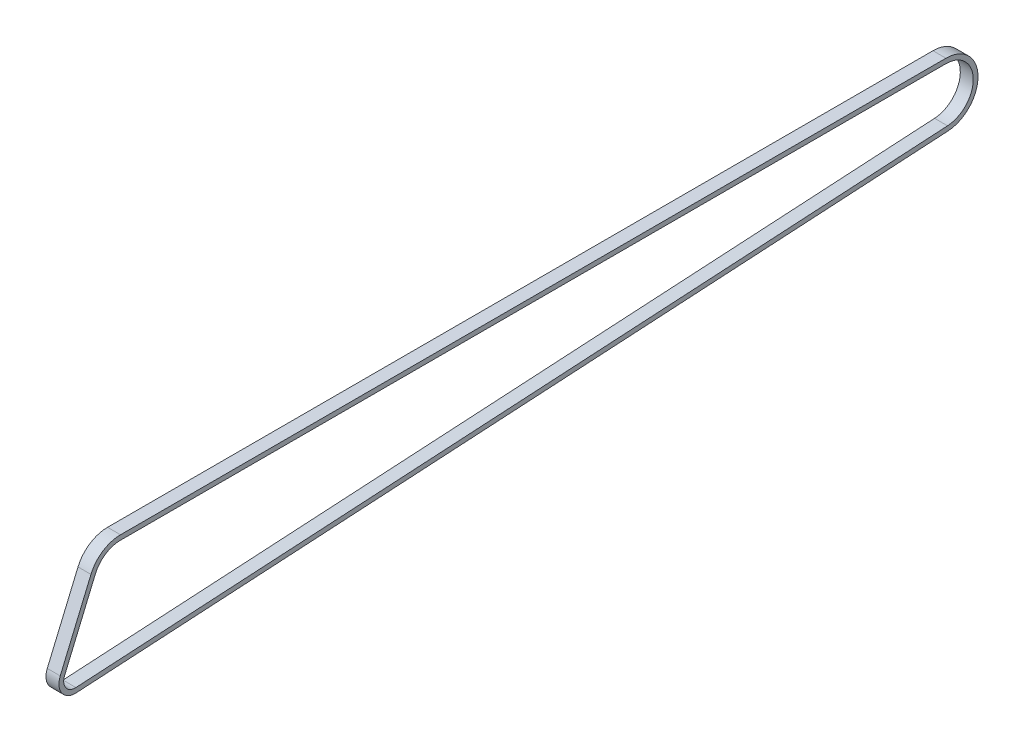
ISO-10303-21;
HEADER;
FILE_DESCRIPTION(('STEP AP214'),'2;1');
FILE_NAME('part.step','',(''),(''),'','','');
FILE_SCHEMA(('AUTOMOTIVE_DESIGN { 1 0 10303 214 1 1 1 1 }'));
ENDSEC;
DATA;
#1=APPLICATION_CONTEXT('core data for automotive mechanical design processes');
#2=APPLICATION_PROTOCOL_DEFINITION('international standard','automotive_design',2000,#1);
#3=PRODUCT_CONTEXT('',#1,'mechanical');
#4=PRODUCT('Part','Part','',(#3));
#5=PRODUCT_RELATED_PRODUCT_CATEGORY('part','',(#4));
#6=PRODUCT_DEFINITION_FORMATION('','',#4);
#7=PRODUCT_DEFINITION_CONTEXT('part definition',#1,'design');
#8=PRODUCT_DEFINITION('design','',#6,#7);
#9=PRODUCT_DEFINITION_SHAPE('','',#8);
#10=(LENGTH_UNIT() NAMED_UNIT(*) SI_UNIT(.MILLI.,.METRE.));
#11=(NAMED_UNIT(*) PLANE_ANGLE_UNIT() SI_UNIT($,.RADIAN.));
#12=(NAMED_UNIT(*) SI_UNIT($,.STERADIAN.) SOLID_ANGLE_UNIT());
#13=UNCERTAINTY_MEASURE_WITH_UNIT(LENGTH_MEASURE(1.E-05),#10,'distance_accuracy_value','');
#14=(GEOMETRIC_REPRESENTATION_CONTEXT(3) GLOBAL_UNCERTAINTY_ASSIGNED_CONTEXT((#13)) GLOBAL_UNIT_ASSIGNED_CONTEXT((#10,
#11,#12)) REPRESENTATION_CONTEXT('',''));
#15=CARTESIAN_POINT('',(0.,0.,0.));
#16=DIRECTION('',(0.,0.,1.));
#17=DIRECTION('',(1.,0.,0.));
#18=AXIS2_PLACEMENT_3D('',#15,#16,#17);
#19=CARTESIAN_POINT('',(0.,0.,0.));
#20=DIRECTION('',(-1.,0.,0.));
#21=DIRECTION('',(0.,0.,1.));
#22=AXIS2_PLACEMENT_3D('',#19,#20,#21);
#23=CYLINDRICAL_SURFACE('',#22,7.5564349965101);
#24=DIRECTION('',(-1.,0.,0.));
#25=VECTOR('',#24,1.);
#26=CARTESIAN_POINT('',(-3.,-7.54369576801666,-0.438593223944628));
#27=LINE('',#26,#25);
#28=CARTESIAN_POINT('',(3.,-7.54369576801666,-0.438593223944628));
#29=VERTEX_POINT('',#28);
#30=CARTESIAN_POINT('',(-3.,-7.54369576801666,-0.438593223944628));
#31=VERTEX_POINT('',#30);
#32=EDGE_CURVE('E270',#29,#31,#27,.T.);
#33=ORIENTED_EDGE('',*,*,#32,.F.);
#34=CARTESIAN_POINT('',(3.,0.,0.));
#35=DIRECTION('',(-1.,0.,0.));
#36=DIRECTION('',(0.,0.,1.));
#37=AXIS2_PLACEMENT_3D('',#34,#35,#36);
#38=CIRCLE('',#37,7.5564349965101);
#39=CARTESIAN_POINT('',(3.,2.94703128453617,6.95806844350122));
#40=VERTEX_POINT('',#39);
#41=EDGE_CURVE('E51',#29,#40,#38,.T.);
#42=ORIENTED_EDGE('',*,*,#41,.T.);
#43=CARTESIAN_POINT('',(3.,2.94703128453614,6.95806844350124));
#44=DIRECTION('',(-1.,0.,0.));
#45=VECTOR('',#44,1.);
#46=LINE('',#43,#45);
#47=CARTESIAN_POINT('',(-3.,2.94703128453614,6.95806844350124));
#48=VERTEX_POINT('',#47);
#49=EDGE_CURVE('E182',#40,#48,#46,.T.);
#50=ORIENTED_EDGE('',*,*,#49,.T.);
#51=CARTESIAN_POINT('',(-3.,0.,0.));
#52=DIRECTION('',(-1.,0.,0.));
#53=DIRECTION('',(0.,0.,1.));
#54=AXIS2_PLACEMENT_3D('',#51,#52,#53);
#55=CIRCLE('',#54,7.5564349965101);
#56=EDGE_CURVE('E11',#31,#48,#55,.T.);
#57=ORIENTED_EDGE('',*,*,#56,.F.);
#58=EDGE_LOOP('',(#33,#42,#50,#57));
#59=FACE_BOUND('',#58,.T.);
#60=ADVANCED_FACE('F39',(#59),#23,.T.);
#61=CARTESIAN_POINT('',(0.,0.,0.));
#62=DIRECTION('',(-1.,0.,0.));
#63=DIRECTION('',(0.,0.,1.));
#64=AXIS2_PLACEMENT_3D('',#61,#62,#63);
#65=CYLINDRICAL_SURFACE('',#64,5.35643499651009);
#66=DIRECTION('',(1.,0.,0.));
#67=VECTOR('',#66,1.);
#68=CARTESIAN_POINT('',(-3.,-5.34740469990034,-0.310900060022268));
#69=LINE('',#68,#67);
#70=CARTESIAN_POINT('',(-3.,-5.34740469990034,-0.310900060022268));
#71=VERTEX_POINT('',#70);
#72=CARTESIAN_POINT('',(3.,-5.34740469990034,-0.310900060022268));
#73=VERTEX_POINT('',#72);
#74=EDGE_CURVE('E278',#71,#73,#69,.T.);
#75=ORIENTED_EDGE('',*,*,#74,.F.);
#76=CARTESIAN_POINT('',(-3.,0.,0.));
#77=DIRECTION('',(-1.,0.,0.));
#78=DIRECTION('',(0.,0.,1.));
#79=AXIS2_PLACEMENT_3D('',#76,#77,#78);
#80=CIRCLE('',#79,5.35643499651009);
#81=CARTESIAN_POINT('',(-3.,2.08902498540513,4.93227842707517));
#82=VERTEX_POINT('',#81);
#83=EDGE_CURVE('E67',#71,#82,#80,.T.);
#84=ORIENTED_EDGE('',*,*,#83,.T.);
#85=CARTESIAN_POINT('',(-3.,2.08902498540513,4.93227842707517));
#86=DIRECTION('',(1.,0.,0.));
#87=VECTOR('',#86,1.);
#88=LINE('',#85,#87);
#89=CARTESIAN_POINT('',(3.,2.08902498540517,4.93227842707515));
#90=VERTEX_POINT('',#89);
#91=EDGE_CURVE('E165',#82,#90,#88,.T.);
#92=ORIENTED_EDGE('',*,*,#91,.T.);
#93=CARTESIAN_POINT('',(3.,0.,0.));
#94=DIRECTION('',(-1.,0.,0.));
#95=DIRECTION('',(0.,0.,1.));
#96=AXIS2_PLACEMENT_3D('',#93,#94,#95);
#97=CIRCLE('',#96,5.35643499651009);
#98=EDGE_CURVE('E302',#73,#90,#97,.T.);
#99=ORIENTED_EDGE('',*,*,#98,.F.);
#100=EDGE_LOOP('',(#75,#84,#92,#99));
#101=FACE_BOUND('',#100,.T.);
#102=ADVANCED_FACE('F234',(#101),#65,.F.);
#103=CARTESIAN_POINT('',(-3.,15.919956904702,-404.007658376128));
#104=DIRECTION('',(0.,0.998314121871051,0.0580423472374411));
#105=DIRECTION('',(0.,-0.0580423472374411,0.998314121871051));
#106=AXIS2_PLACEMENT_3D('',#103,#104,#105);
#107=PLANE('',#106);
#108=DIRECTION('',(-1.,0.,0.));
#109=VECTOR('',#108,1.);
#110=CARTESIAN_POINT('',(-3.,15.919956904702,-404.007658376128));
#111=LINE('',#110,#109);
#112=CARTESIAN_POINT('',(3.,15.919956904702,-404.007658376128));
#113=VERTEX_POINT('',#112);
#114=CARTESIAN_POINT('',(-3.,15.919956904702,-404.007658376128));
#115=VERTEX_POINT('',#114);
#116=EDGE_CURVE('E326',#113,#115,#111,.T.);
#117=ORIENTED_EDGE('',*,*,#116,.F.);
#118=DIRECTION('',(0.,-0.0580423472374411,0.998314121871051));
#119=VECTOR('',#118,1.);
#120=CARTESIAN_POINT('',(3.,15.919956904702,-404.007658376128));
#121=LINE('',#120,#119);
#122=EDGE_CURVE('E275',#113,#29,#121,.T.);
#123=ORIENTED_EDGE('',*,*,#122,.T.);
#124=ORIENTED_EDGE('',*,*,#32,.T.);
#125=DIRECTION('',(0.,-0.0580423472374411,0.998314121871051));
#126=VECTOR('',#125,1.);
#127=CARTESIAN_POINT('',(-3.,15.919956904702,-404.007658376128));
#128=LINE('',#127,#126);
#129=EDGE_CURVE('E267',#115,#31,#128,.T.);
#130=ORIENTED_EDGE('',*,*,#129,.F.);
#131=EDGE_LOOP('',(#117,#123,#124,#130));
#132=FACE_BOUND('',#131,.T.);
#133=ADVANCED_FACE('F231',(#132),#107,.F.);
#134=CARTESIAN_POINT('',(-3.,18.1162479728183,-403.879965212205));
#135=DIRECTION('',(0.,-0.998314121871051,-0.0580423472374411));
#136=DIRECTION('',(0.,0.0580423472374411,-0.998314121871051));
#137=AXIS2_PLACEMENT_3D('',#134,#135,#136);
#138=PLANE('',#137);
#139=DIRECTION('',(1.,0.,0.));
#140=VECTOR('',#139,1.);
#141=CARTESIAN_POINT('',(-3.,18.1162479728183,-403.879965212205));
#142=LINE('',#141,#140);
#143=CARTESIAN_POINT('',(-3.,18.1162479728183,-403.879965212205));
#144=VERTEX_POINT('',#143);
#145=CARTESIAN_POINT('',(3.,18.1162479728183,-403.879965212205));
#146=VERTEX_POINT('',#145);
#147=EDGE_CURVE('E321',#144,#146,#142,.T.);
#148=ORIENTED_EDGE('',*,*,#147,.F.);
#149=DIRECTION('',(0.,-0.0580423472374411,0.998314121871051));
#150=VECTOR('',#149,1.);
#151=CARTESIAN_POINT('',(-3.,18.1162479728183,-403.879965212205));
#152=LINE('',#151,#150);
#153=EDGE_CURVE('E277',#144,#71,#152,.T.);
#154=ORIENTED_EDGE('',*,*,#153,.T.);
#155=ORIENTED_EDGE('',*,*,#74,.T.);
#156=DIRECTION('',(0.,-0.0580423472374411,0.998314121871051));
#157=VECTOR('',#156,1.);
#158=CARTESIAN_POINT('',(3.,18.1162479728183,-403.879965212205));
#159=LINE('',#158,#157);
#160=EDGE_CURVE('E283',#146,#73,#159,.T.);
#161=ORIENTED_EDGE('',*,*,#160,.F.);
#162=EDGE_LOOP('',(#148,#154,#155,#161));
#163=FACE_BOUND('',#162,.T.);
#164=ADVANCED_FACE('F227',(#163),#138,.F.);
#165=CARTESIAN_POINT('',(0.,30.7449216144871,-403.145729519651));
#166=DIRECTION('',(-1.,0.,0.));
#167=DIRECTION('',(0.,0.,1.));
#168=AXIS2_PLACEMENT_3D('',#165,#166,#167);
#169=CYLINDRICAL_SURFACE('',#168,14.85);
#170=DIRECTION('',(-1.,0.,0.));
#171=VECTOR('',#170,1.);
#172=CARTESIAN_POINT('',(-3.,45.5949216144871,-403.145729519652));
#173=LINE('',#172,#171);
#174=CARTESIAN_POINT('',(3.,45.5949216144871,-403.145729519652));
#175=VERTEX_POINT('',#174);
#176=CARTESIAN_POINT('',(-3.,45.5949216144871,-403.145729519652));
#177=VERTEX_POINT('',#176);
#178=EDGE_CURVE('E330',#175,#177,#173,.T.);
#179=ORIENTED_EDGE('',*,*,#178,.F.);
#180=CARTESIAN_POINT('',(3.,30.7449216144871,-403.145729519651));
#181=DIRECTION('',(-1.,0.,0.));
#182=DIRECTION('',(0.,0.,1.));
#183=AXIS2_PLACEMENT_3D('',#180,#181,#182);
#184=CIRCLE('',#183,14.85);
#185=EDGE_CURVE('E351',#175,#113,#184,.T.);
#186=ORIENTED_EDGE('',*,*,#185,.T.);
#187=ORIENTED_EDGE('',*,*,#116,.T.);
#188=CARTESIAN_POINT('',(-3.,30.7449216144871,-403.145729519651));
#189=DIRECTION('',(-1.,0.,0.));
#190=DIRECTION('',(0.,0.,1.));
#191=AXIS2_PLACEMENT_3D('',#188,#189,#190);
#192=CIRCLE('',#191,14.85);
#193=EDGE_CURVE('E287',#177,#115,#192,.T.);
#194=ORIENTED_EDGE('',*,*,#193,.F.);
#195=EDGE_LOOP('',(#179,#186,#187,#194));
#196=FACE_BOUND('',#195,.T.);
#197=ADVANCED_FACE('F223',(#196),#169,.T.);
#198=CARTESIAN_POINT('',(0.,30.7449216144871,-403.145729519651));
#199=DIRECTION('',(-1.,0.,0.));
#200=DIRECTION('',(0.,0.,1.));
#201=AXIS2_PLACEMENT_3D('',#198,#199,#200);
#202=CYLINDRICAL_SURFACE('',#201,12.65);
#203=DIRECTION('',(1.,0.,0.));
#204=VECTOR('',#203,1.);
#205=CARTESIAN_POINT('',(-3.,43.3949216144871,-403.145729519652));
#206=LINE('',#205,#204);
#207=CARTESIAN_POINT('',(-3.,43.3949216144871,-403.145729519652));
#208=VERTEX_POINT('',#207);
#209=CARTESIAN_POINT('',(3.,43.3949216144871,-403.145729519652));
#210=VERTEX_POINT('',#209);
#211=EDGE_CURVE('E263',#208,#210,#206,.T.);
#212=ORIENTED_EDGE('',*,*,#211,.F.);
#213=CARTESIAN_POINT('',(-3.,30.7449216144871,-403.145729519651));
#214=DIRECTION('',(-1.,0.,0.));
#215=DIRECTION('',(0.,0.,1.));
#216=AXIS2_PLACEMENT_3D('',#213,#214,#215);
#217=CIRCLE('',#216,12.65);
#218=EDGE_CURVE('E323',#208,#144,#217,.T.);
#219=ORIENTED_EDGE('',*,*,#218,.T.);
#220=ORIENTED_EDGE('',*,*,#147,.T.);
#221=CARTESIAN_POINT('',(3.,30.7449216144871,-403.145729519651));
#222=DIRECTION('',(-1.,0.,0.));
#223=DIRECTION('',(0.,0.,1.));
#224=AXIS2_PLACEMENT_3D('',#221,#222,#223);
#225=CIRCLE('',#224,12.65);
#226=EDGE_CURVE('E325',#210,#146,#225,.T.);
#227=ORIENTED_EDGE('',*,*,#226,.F.);
#228=EDGE_LOOP('',(#212,#219,#220,#227));
#229=FACE_BOUND('',#228,.T.);
#230=ADVANCED_FACE('F219',(#229),#202,.F.);
#231=CARTESIAN_POINT('',(-3.,45.5949216144885,-20.9425355417859));
#232=DIRECTION('',(0.,-1.,0.));
#233=DIRECTION('',(0.,0.,-1.));
#234=AXIS2_PLACEMENT_3D('',#231,#232,#233);
#235=PLANE('',#234);
#236=DIRECTION('',(-1.,0.,0.));
#237=VECTOR('',#236,1.);
#238=CARTESIAN_POINT('',(-3.,45.5949216144885,-20.9425355417859));
#239=LINE('',#238,#237);
#240=CARTESIAN_POINT('',(3.,45.5949216144885,-20.9425355417859));
#241=VERTEX_POINT('',#240);
#242=CARTESIAN_POINT('',(-3.,45.5949216144885,-20.9425355417859));
#243=VERTEX_POINT('',#242);
#244=EDGE_CURVE('E153',#241,#243,#239,.T.);
#245=ORIENTED_EDGE('',*,*,#244,.F.);
#246=DIRECTION('',(0.,0.,-1.));
#247=VECTOR('',#246,1.);
#248=CARTESIAN_POINT('',(3.,45.5949216144885,-20.9425355417859));
#249=LINE('',#248,#247);
#250=EDGE_CURVE('E338',#241,#175,#249,.T.);
#251=ORIENTED_EDGE('',*,*,#250,.T.);
#252=ORIENTED_EDGE('',*,*,#178,.T.);
#253=DIRECTION('',(0.,0.,-1.));
#254=VECTOR('',#253,1.);
#255=CARTESIAN_POINT('',(-3.,45.5949216144885,-20.9425355417859));
#256=LINE('',#255,#254);
#257=EDGE_CURVE('E346',#243,#177,#256,.T.);
#258=ORIENTED_EDGE('',*,*,#257,.F.);
#259=EDGE_LOOP('',(#245,#251,#252,#258));
#260=FACE_BOUND('',#259,.T.);
#261=ADVANCED_FACE('F215',(#260),#235,.F.);
#262=CARTESIAN_POINT('',(-3.,43.3949216144885,-20.9425355417859));
#263=DIRECTION('',(0.,1.,0.));
#264=DIRECTION('',(0.,0.,1.));
#265=AXIS2_PLACEMENT_3D('',#262,#263,#264);
#266=PLANE('',#265);
#267=DIRECTION('',(1.,0.,0.));
#268=VECTOR('',#267,1.);
#269=CARTESIAN_POINT('',(-3.,43.3949216144885,-20.9425355417859));
#270=LINE('',#269,#268);
#271=CARTESIAN_POINT('',(-3.,43.3949216144885,-20.9425355417859));
#272=VERTEX_POINT('',#271);
#273=CARTESIAN_POINT('',(3.,43.3949216144885,-20.9425355417859));
#274=VERTEX_POINT('',#273);
#275=EDGE_CURVE('E249',#272,#274,#270,.T.);
#276=ORIENTED_EDGE('',*,*,#275,.F.);
#277=DIRECTION('',(0.,0.,-1.));
#278=VECTOR('',#277,1.);
#279=CARTESIAN_POINT('',(-3.,43.3949216144885,-20.9425355417859));
#280=LINE('',#279,#278);
#281=EDGE_CURVE('E147',#272,#208,#280,.T.);
#282=ORIENTED_EDGE('',*,*,#281,.T.);
#283=ORIENTED_EDGE('',*,*,#211,.T.);
#284=DIRECTION('',(0.,0.,-1.));
#285=VECTOR('',#284,1.);
#286=CARTESIAN_POINT('',(3.,43.3949216144885,-20.9425355417859));
#287=LINE('',#286,#285);
#288=EDGE_CURVE('E333',#274,#210,#287,.T.);
#289=ORIENTED_EDGE('',*,*,#288,.F.);
#290=EDGE_LOOP('',(#276,#282,#283,#289));
#291=FACE_BOUND('',#290,.T.);
#292=ADVANCED_FACE('F211',(#291),#266,.F.);
#293=CARTESIAN_POINT('',(0.,30.7449216144885,-20.9425355417858));
#294=DIRECTION('',(-1.,0.,0.));
#295=DIRECTION('',(0.,0.,1.));
#296=AXIS2_PLACEMENT_3D('',#293,#294,#295);
#297=CYLINDRICAL_SURFACE('',#296,14.85);
#298=DIRECTION('',(-1.,0.,0.));
#299=VECTOR('',#298,1.);
#300=CARTESIAN_POINT('',(-3.,36.5364641336227,-7.26845293090983));
#301=LINE('',#300,#299);
#302=CARTESIAN_POINT('',(3.,36.5364641336227,-7.26845293090983));
#303=VERTEX_POINT('',#302);
#304=CARTESIAN_POINT('',(-3.,36.5364641336227,-7.26845293090983));
#305=VERTEX_POINT('',#304);
#306=EDGE_CURVE('E162',#303,#305,#301,.T.);
#307=ORIENTED_EDGE('',*,*,#306,.F.);
#308=CARTESIAN_POINT('',(3.,30.7449216144885,-20.9425355417858));
#309=DIRECTION('',(-1.,0.,0.));
#310=DIRECTION('',(0.,0.,1.));
#311=AXIS2_PLACEMENT_3D('',#308,#309,#310);
#312=CIRCLE('',#311,14.85);
#313=EDGE_CURVE('E256',#303,#241,#312,.T.);
#314=ORIENTED_EDGE('',*,*,#313,.T.);
#315=ORIENTED_EDGE('',*,*,#244,.T.);
#316=CARTESIAN_POINT('',(-3.,30.7449216144885,-20.9425355417858));
#317=DIRECTION('',(-1.,0.,0.));
#318=DIRECTION('',(0.,0.,1.));
#319=AXIS2_PLACEMENT_3D('',#316,#317,#318);
#320=CIRCLE('',#319,14.85);
#321=EDGE_CURVE('E260',#305,#243,#320,.T.);
#322=ORIENTED_EDGE('',*,*,#321,.F.);
#323=EDGE_LOOP('',(#307,#314,#315,#322));
#324=FACE_BOUND('',#323,.T.);
#325=ADVANCED_FACE('F208',(#324),#297,.T.);
#326=CARTESIAN_POINT('',(0.,30.7449216144885,-20.9425355417858));
#327=DIRECTION('',(-1.,0.,0.));
#328=DIRECTION('',(0.,0.,1.));
#329=AXIS2_PLACEMENT_3D('',#326,#327,#328);
#330=CYLINDRICAL_SURFACE('',#329,12.65);
#331=DIRECTION('',(1.,0.,0.));
#332=VECTOR('',#331,1.);
#333=CARTESIAN_POINT('',(-3.,35.6784578344917,-9.2942429473359));
#334=LINE('',#333,#332);
#335=CARTESIAN_POINT('',(-3.,35.6784578344917,-9.2942429473359));
#336=VERTEX_POINT('',#335);
#337=CARTESIAN_POINT('',(3.,35.6784578344917,-9.2942429473359));
#338=VERTEX_POINT('',#337);
#339=EDGE_CURVE('E156',#336,#338,#334,.T.);
#340=ORIENTED_EDGE('',*,*,#339,.F.);
#341=CARTESIAN_POINT('',(-3.,30.7449216144885,-20.9425355417858));
#342=DIRECTION('',(-1.,0.,0.));
#343=DIRECTION('',(0.,0.,1.));
#344=AXIS2_PLACEMENT_3D('',#341,#342,#343);
#345=CIRCLE('',#344,12.65);
#346=EDGE_CURVE('E139',#336,#272,#345,.T.);
#347=ORIENTED_EDGE('',*,*,#346,.T.);
#348=ORIENTED_EDGE('',*,*,#275,.T.);
#349=CARTESIAN_POINT('',(3.,30.7449216144885,-20.9425355417858));
#350=DIRECTION('',(-1.,0.,0.));
#351=DIRECTION('',(0.,0.,1.));
#352=AXIS2_PLACEMENT_3D('',#349,#350,#351);
#353=CIRCLE('',#352,12.65);
#354=EDGE_CURVE('E152',#338,#274,#353,.T.);
#355=ORIENTED_EDGE('',*,*,#354,.F.);
#356=EDGE_LOOP('',(#340,#347,#348,#355));
#357=FACE_BOUND('',#356,.T.);
#358=ADVANCED_FACE('F157',(#357),#330,.F.);
#359=CARTESIAN_POINT('',(-3.,36.5364641336227,-7.26845293090983));
#360=DIRECTION('',(-1.,0.,0.));
#361=DIRECTION('',(0.,0.,1.));
#362=AXIS2_PLACEMENT_3D('',#359,#360,#361);
#363=PLANE('',#362);
#364=ORIENTED_EDGE('',*,*,#346,.F.);
#365=DIRECTION('',(0.,-0.920813643830031,0.390002863241363));
#366=VECTOR('',#365,1.);
#367=CARTESIAN_POINT('',(-3.,35.6784578344917,-9.2942429473359));
#368=LINE('',#367,#366);
#369=EDGE_CURVE('E144',#336,#82,#368,.T.);
#370=ORIENTED_EDGE('',*,*,#369,.T.);
#371=ORIENTED_EDGE('',*,*,#83,.F.);
#372=ORIENTED_EDGE('',*,*,#153,.F.);
#373=ORIENTED_EDGE('',*,*,#218,.F.);
#374=ORIENTED_EDGE('',*,*,#281,.F.);
#375=EDGE_LOOP('',(#364,#370,#371,#372,#373,#374));
#376=FACE_BOUND('',#375,.T.);
#377=DIRECTION('',(0.,-0.920813643830031,0.390002863241363));
#378=VECTOR('',#377,1.);
#379=CARTESIAN_POINT('',(-3.,36.5364641336227,-7.26845293090983));
#380=LINE('',#379,#378);
#381=EDGE_CURVE('E59',#305,#48,#380,.T.);
#382=ORIENTED_EDGE('',*,*,#381,.F.);
#383=ORIENTED_EDGE('',*,*,#321,.T.);
#384=ORIENTED_EDGE('',*,*,#257,.T.);
#385=ORIENTED_EDGE('',*,*,#193,.T.);
#386=ORIENTED_EDGE('',*,*,#129,.T.);
#387=ORIENTED_EDGE('',*,*,#56,.T.);
#388=EDGE_LOOP('',(#382,#383,#384,#385,#386,#387));
#389=FACE_BOUND('',#388,.T.);
#390=ADVANCED_FACE('F141',(#376,#389),#363,.T.);
#391=CARTESIAN_POINT('',(-3.,36.5364641336227,-7.26845293090983));
#392=DIRECTION('',(0.,0.390002863241363,0.920813643830031));
#393=DIRECTION('',(0.,-0.920813643830031,0.390002863241363));
#394=AXIS2_PLACEMENT_3D('',#391,#392,#393);
#395=PLANE('',#394);
#396=ORIENTED_EDGE('',*,*,#49,.F.);
#397=DIRECTION('',(0.,-0.920813643830031,0.390002863241363));
#398=VECTOR('',#397,1.);
#399=CARTESIAN_POINT('',(3.,36.5364641336227,-7.26845293090983));
#400=LINE('',#399,#398);
#401=EDGE_CURVE('E171',#303,#40,#400,.T.);
#402=ORIENTED_EDGE('',*,*,#401,.F.);
#403=ORIENTED_EDGE('',*,*,#306,.T.);
#404=ORIENTED_EDGE('',*,*,#381,.T.);
#405=EDGE_LOOP('',(#396,#402,#403,#404));
#406=FACE_BOUND('',#405,.T.);
#407=ADVANCED_FACE('F189',(#406),#395,.T.);
#408=CARTESIAN_POINT('',(3.,36.5364641336227,-7.26845293090983));
#409=DIRECTION('',(1.,0.,0.));
#410=DIRECTION('',(0.,0.,-1.));
#411=AXIS2_PLACEMENT_3D('',#408,#409,#410);
#412=PLANE('',#411);
#413=ORIENTED_EDGE('',*,*,#313,.F.);
#414=ORIENTED_EDGE('',*,*,#401,.T.);
#415=ORIENTED_EDGE('',*,*,#41,.F.);
#416=ORIENTED_EDGE('',*,*,#122,.F.);
#417=ORIENTED_EDGE('',*,*,#185,.F.);
#418=ORIENTED_EDGE('',*,*,#250,.F.);
#419=EDGE_LOOP('',(#413,#414,#415,#416,#417,#418));
#420=FACE_BOUND('',#419,.T.);
#421=DIRECTION('',(0.,-0.920813643830031,0.390002863241363));
#422=VECTOR('',#421,1.);
#423=CARTESIAN_POINT('',(3.,35.6784578344917,-9.2942429473359));
#424=LINE('',#423,#422);
#425=EDGE_CURVE('E167',#338,#90,#424,.T.);
#426=ORIENTED_EDGE('',*,*,#425,.F.);
#427=ORIENTED_EDGE('',*,*,#354,.T.);
#428=ORIENTED_EDGE('',*,*,#288,.T.);
#429=ORIENTED_EDGE('',*,*,#226,.T.);
#430=ORIENTED_EDGE('',*,*,#160,.T.);
#431=ORIENTED_EDGE('',*,*,#98,.T.);
#432=EDGE_LOOP('',(#426,#427,#428,#429,#430,#431));
#433=FACE_BOUND('',#432,.T.);
#434=ADVANCED_FACE('F198',(#420,#433),#412,.T.);
#435=CARTESIAN_POINT('',(-3.,35.6784578344917,-9.2942429473359));
#436=DIRECTION('',(0.,-0.390002863241363,-0.920813643830031));
#437=DIRECTION('',(0.,0.920813643830031,-0.390002863241363));
#438=AXIS2_PLACEMENT_3D('',#435,#436,#437);
#439=PLANE('',#438);
#440=ORIENTED_EDGE('',*,*,#91,.F.);
#441=ORIENTED_EDGE('',*,*,#369,.F.);
#442=ORIENTED_EDGE('',*,*,#339,.T.);
#443=ORIENTED_EDGE('',*,*,#425,.T.);
#444=EDGE_LOOP('',(#440,#441,#442,#443));
#445=FACE_BOUND('',#444,.T.);
#446=ADVANCED_FACE('F164',(#445),#439,.T.);
#447=CLOSED_SHELL('',(#60,#102,#133,#164,#197,#230,#261,#292,#325,#358,#390,#407,#434,#446));
#448=MANIFOLD_SOLID_BREP('B2',#447);
#449=ADVANCED_BREP_SHAPE_REPRESENTATION('',(#18,#448),#14);
#450=SHAPE_DEFINITION_REPRESENTATION(#9,#449);
ENDSEC;
END-ISO-10303-21;
